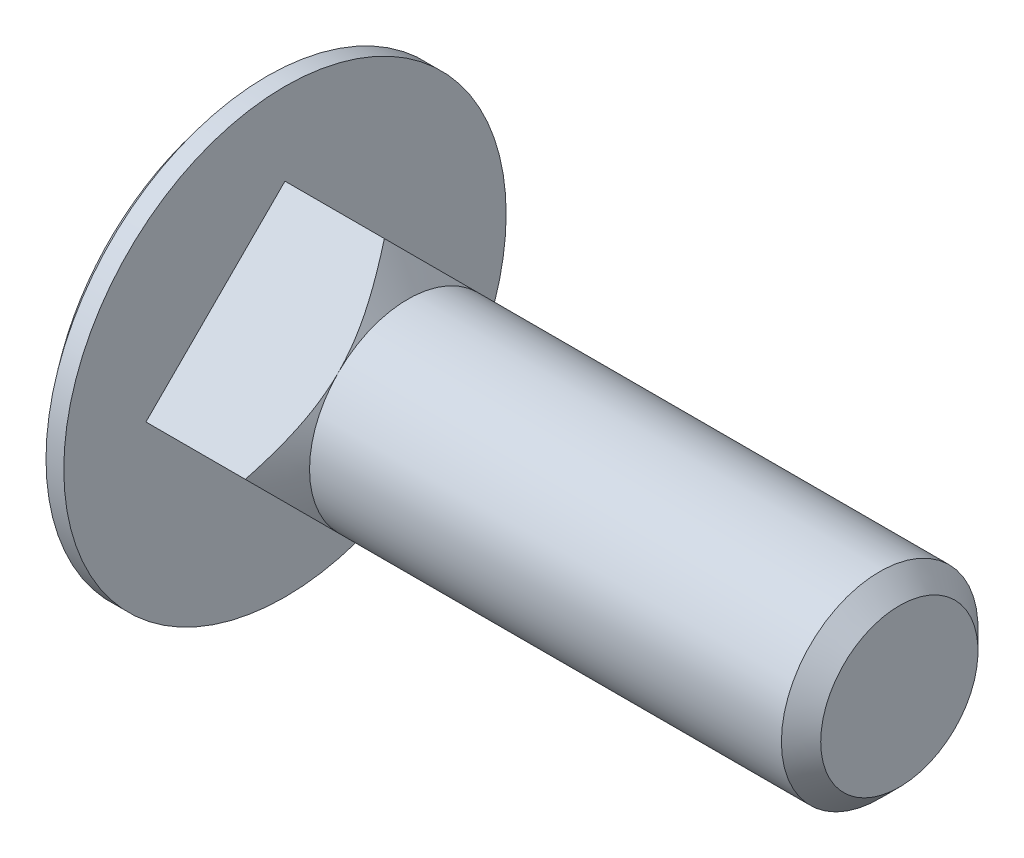
ISO-10303-21;
HEADER;
FILE_DESCRIPTION(('STEP AP214'),'2;1');
FILE_NAME('part.step','',(''),(''),'','','');
FILE_SCHEMA(('AUTOMOTIVE_DESIGN { 1 0 10303 214 1 1 1 1 }'));
ENDSEC;
DATA;
#1=APPLICATION_CONTEXT('core data for automotive mechanical design processes');
#2=APPLICATION_PROTOCOL_DEFINITION('international standard','automotive_design',2000,#1);
#3=PRODUCT_CONTEXT('',#1,'mechanical');
#4=PRODUCT('Part','Part','',(#3));
#5=PRODUCT_RELATED_PRODUCT_CATEGORY('part','',(#4));
#6=PRODUCT_DEFINITION_FORMATION('','',#4);
#7=PRODUCT_DEFINITION_CONTEXT('part definition',#1,'design');
#8=PRODUCT_DEFINITION('design','',#6,#7);
#9=PRODUCT_DEFINITION_SHAPE('','',#8);
#10=(LENGTH_UNIT() NAMED_UNIT(*) SI_UNIT(.MILLI.,.METRE.));
#11=(NAMED_UNIT(*) PLANE_ANGLE_UNIT() SI_UNIT($,.RADIAN.));
#12=(NAMED_UNIT(*) SI_UNIT($,.STERADIAN.) SOLID_ANGLE_UNIT());
#13=UNCERTAINTY_MEASURE_WITH_UNIT(LENGTH_MEASURE(1.E-05),#10,'distance_accuracy_value','');
#14=(GEOMETRIC_REPRESENTATION_CONTEXT(3) GLOBAL_UNCERTAINTY_ASSIGNED_CONTEXT((#13)) GLOBAL_UNIT_ASSIGNED_CONTEXT((#10,
#11,#12)) REPRESENTATION_CONTEXT('',''));
#15=CARTESIAN_POINT('',(0.,0.,0.));
#16=DIRECTION('',(0.,0.,1.));
#17=DIRECTION('',(1.,0.,0.));
#18=AXIS2_PLACEMENT_3D('',#15,#16,#17);
#19=CARTESIAN_POINT('',(5.,0.,-5.65685424949238));
#20=DIRECTION('',(0.,-0.707106781186548,0.707106781186547));
#21=DIRECTION('',(0.,-0.707106781186547,-0.707106781186548));
#22=AXIS2_PLACEMENT_3D('',#19,#20,#21);
#23=PLANE('',#22);
#24=CARTESIAN_POINT('',(4.0432992809527,-0.000199999999997203,-5.65705424949238));
#25=CARTESIAN_POINT('',(4.0988121730849,0.0959826975610581,-5.56087155193133));
#26=CARTESIAN_POINT('',(4.15314874397081,0.192512925868356,-5.46434132362403));
#27=CARTESIAN_POINT('',(4.25891257269784,0.386403970425592,-5.27045027906679));
#28=CARTESIAN_POINT('',(4.31033881318759,0.483765063597329,-5.17308918589505));
#29=CARTESIAN_POINT('',(4.40999239195148,0.67999010402872,-4.97686414546366));
#30=CARTESIAN_POINT('',(4.45819803762928,0.778859617281934,-4.87799463221045));
#31=CARTESIAN_POINT('',(4.55030115220739,0.977578113881361,-4.67927613561102));
#32=CARTESIAN_POINT('',(4.59419898628848,1.07742701341258,-4.5794272360798));
#33=CARTESIAN_POINT('',(4.71675397120088,1.37522438523122,-4.28162986426116));
#34=CARTESIAN_POINT('',(4.78803650897061,1.57478406535577,-4.08207018413662));
#35=CARTESIAN_POINT('',(4.87402002674739,1.87685506006528,-3.77999918942711));
#36=CARTESIAN_POINT('',(4.89917571351562,1.97789331377697,-3.67896093571541));
#37=CARTESIAN_POINT('',(4.94158803399933,2.18080322843218,-3.47605102106021));
#38=CARTESIAN_POINT('',(4.95884552100567,2.28267479813648,-3.3741794513559));
#39=CARTESIAN_POINT('',(4.98258260862343,2.47029261100635,-3.18656163848604));
#40=CARTESIAN_POINT('',(4.99036156700102,2.55595707997914,-3.10089716951324));
#41=CARTESIAN_POINT('',(4.99958487505313,2.72745668367036,-2.92939756582202));
#42=CARTESIAN_POINT('',(5.0010294360973,2.8132918125985,-2.84356243689389));
#43=CARTESIAN_POINT('',(4.99752840917008,2.98493500072988,-2.6719192487625));
#44=CARTESIAN_POINT('',(4.99257998405933,3.07074303099898,-2.5861112184934));
#45=CARTESIAN_POINT('',(4.97647161996125,3.24206110933229,-2.41479314016009));
#46=CARTESIAN_POINT('',(4.96531156855998,3.32757115197553,-2.32928309751685));
#47=CARTESIAN_POINT('',(4.92298687780489,3.58365082271443,-2.07320342677795));
#48=CARTESIAN_POINT('',(4.88298481412572,3.75350897480532,-1.90334527468706));
#49=CARTESIAN_POINT('',(4.78385371846953,4.09033307136895,-1.56652117812343));
#50=CARTESIAN_POINT('',(4.72472024883252,4.2572983353407,-1.39955591415168));
#51=CARTESIAN_POINT('',(4.61615701149807,4.52805544879868,-1.1287988006937));
#52=CARTESIAN_POINT('',(4.57102353308653,4.63273158851329,-1.02412266097909));
#53=CARTESIAN_POINT('',(4.47593584045967,4.84094698841374,-0.815907261078638));
#54=CARTESIAN_POINT('',(4.42598307451155,4.944486579796,-0.712367669696385));
#55=CARTESIAN_POINT('',(4.32239305174513,5.1500306413531,-0.506823608139283));
#56=CARTESIAN_POINT('',(4.26877610864834,5.25204027280366,-0.404813976688719));
#57=CARTESIAN_POINT('',(4.15830115357197,5.45517888423679,-0.201675365255595));
#58=CARTESIAN_POINT('',(4.10144317734359,5.55630787391935,-0.100546375573026));
#59=CARTESIAN_POINT('',(4.0432992809527,5.65705424949238,0.000200000000000509));
#60=B_SPLINE_CURVE_WITH_KNOTS('',3,(#24,#25,#26,#27,#28,#29,#30,#31,#32,#33,#34,#35,#36,#37,#38,
#39,#40,#41,#42,#43,#44,#45,#46,#47,#48,#49,#50,#51,#52,#53,#54,#55,#56,#57,#58,#59),
.UNSPECIFIED.,.F.,.F.,(4,2,2,2,2,2,2,2,2,2,2,2,2,2,2,2,2,4),(0.,0.440752806504666,
0.881658745236336,1.32528480094056,1.76887321713796,2.64086686263563,3.07595260990611,
3.51099134109739,3.87502779768151,4.23905210680467,4.60323802155864,4.96743052732496,
5.69691808802417,6.42657497979712,6.89077929314766,7.35484453820602,7.81651833086278,
8.27818703187038),.UNSPECIFIED.);
#61=CARTESIAN_POINT('',(4.0434147530477,0.,-5.65685424949238));
#62=VERTEX_POINT('',#61);
#63=CARTESIAN_POINT('',(4.99999999999989,2.82842712474619,-2.82842712474619));
#64=VERTEX_POINT('',#63);
#65=EDGE_CURVE('E225',#62,#64,#60,.T.);
#66=ORIENTED_EDGE('',*,*,#65,.F.);
#67=DIRECTION('',(-1.,0.,0.));
#68=VECTOR('',#67,1.);
#69=CARTESIAN_POINT('',(5.,0.,-5.65685424949238));
#70=LINE('',#69,#68);
#71=CARTESIAN_POINT('',(0.,0.,-5.65685424949238));
#72=VERTEX_POINT('',#71);
#73=EDGE_CURVE('E168',#62,#72,#70,.T.);
#74=ORIENTED_EDGE('',*,*,#73,.T.);
#75=DIRECTION('',(0.,0.707106781186547,0.707106781186548));
#76=VECTOR('',#75,1.);
#77=CARTESIAN_POINT('',(0.,0.,-5.65685424949238));
#78=LINE('',#77,#76);
#79=CARTESIAN_POINT('',(0.,5.65685424949238,0.));
#80=VERTEX_POINT('',#79);
#81=EDGE_CURVE('E223',#72,#80,#78,.T.);
#82=ORIENTED_EDGE('',*,*,#81,.T.);
#83=DIRECTION('',(-1.,0.,0.));
#84=VECTOR('',#83,1.);
#85=CARTESIAN_POINT('',(5.,5.65685424949238,0.));
#86=LINE('',#85,#84);
#87=CARTESIAN_POINT('',(4.0434147530477,5.65685424949238,0.));
#88=VERTEX_POINT('',#87);
#89=EDGE_CURVE('E170',#88,#80,#86,.T.);
#90=ORIENTED_EDGE('',*,*,#89,.F.);
#91=EDGE_CURVE('E96',#64,#88,#60,.T.);
#92=ORIENTED_EDGE('',*,*,#91,.F.);
#93=EDGE_LOOP('',(#66,#74,#82,#90,#92));
#94=FACE_BOUND('',#93,.T.);
#95=ADVANCED_FACE('F37',(#94),#23,.F.);
#96=CARTESIAN_POINT('',(5.,5.65685424949238,0.));
#97=DIRECTION('',(0.,-0.707106781186547,-0.707106781186548));
#98=DIRECTION('',(0.,0.707106781186548,-0.707106781186547));
#99=AXIS2_PLACEMENT_3D('',#96,#97,#98);
#100=PLANE('',#99);
#101=CARTESIAN_POINT('',(4.0432992809527,5.65705424949238,-0.000199999999999517));
#102=CARTESIAN_POINT('',(4.0988121730849,5.56087155193133,0.0959826975610555));
#103=CARTESIAN_POINT('',(4.15314874397081,5.46434132362403,0.192512925868354));
#104=CARTESIAN_POINT('',(4.25891257269784,5.27045027906679,0.386403970425589));
#105=CARTESIAN_POINT('',(4.31033881318759,5.17308918589505,0.483765063597326));
#106=CARTESIAN_POINT('',(4.40999239195148,4.97686414546367,0.679990104028717));
#107=CARTESIAN_POINT('',(4.45819803762928,4.87799463221045,0.778859617281931));
#108=CARTESIAN_POINT('',(4.55030115220739,4.67927613561102,0.977578113881358));
#109=CARTESIAN_POINT('',(4.59419898628848,4.5794272360798,1.07742701341258));
#110=CARTESIAN_POINT('',(4.71675397120088,4.28162986426116,1.37522438523122));
#111=CARTESIAN_POINT('',(4.78803650897062,4.08207018413662,1.57478406535577));
#112=CARTESIAN_POINT('',(4.87402002674739,3.77999918942711,1.87685506006528));
#113=CARTESIAN_POINT('',(4.89917571351562,3.67896093571541,1.97789331377697));
#114=CARTESIAN_POINT('',(4.94158803399933,3.47605102106021,2.18080322843217));
#115=CARTESIAN_POINT('',(4.95884552100567,3.3741794513559,2.28267479813648));
#116=CARTESIAN_POINT('',(4.98258260862343,3.18656163848604,2.47029261100634));
#117=CARTESIAN_POINT('',(4.99036156700102,3.10089716951324,2.55595707997914));
#118=CARTESIAN_POINT('',(4.99958487505313,2.92939756582202,2.72745668367036));
#119=CARTESIAN_POINT('',(5.0010294360973,2.84356243689388,2.8132918125985));
#120=CARTESIAN_POINT('',(4.99752840917008,2.6719192487625,2.98493500072988));
#121=CARTESIAN_POINT('',(4.99257998405933,2.5861112184934,3.07074303099898));
#122=CARTESIAN_POINT('',(4.97647161996125,2.41479314016009,3.24206110933229));
#123=CARTESIAN_POINT('',(4.96531156855998,2.32928309751685,3.32757115197553));
#124=CARTESIAN_POINT('',(4.92298687780489,2.07320342677795,3.58365082271443));
#125=CARTESIAN_POINT('',(4.88298481412572,1.90334527468706,3.75350897480532));
#126=CARTESIAN_POINT('',(4.78385371846953,1.56652117812343,4.09033307136895));
#127=CARTESIAN_POINT('',(4.72472024883252,1.39955591415168,4.2572983353407));
#128=CARTESIAN_POINT('',(4.61615701149807,1.1287988006937,4.52805544879868));
#129=CARTESIAN_POINT('',(4.57102353308653,1.02412266097909,4.63273158851329));
#130=CARTESIAN_POINT('',(4.47593584045967,0.815907261078637,4.84094698841374));
#131=CARTESIAN_POINT('',(4.42598307451155,0.712367669696384,4.94448657979599));
#132=CARTESIAN_POINT('',(4.32239305174513,0.506823608139283,5.1500306413531));
#133=CARTESIAN_POINT('',(4.26877610864834,0.404813976688719,5.25204027280366));
#134=CARTESIAN_POINT('',(4.15830115357197,0.201675365255595,5.45517888423678));
#135=CARTESIAN_POINT('',(4.10144317734359,0.100546375573025,5.55630787391935));
#136=CARTESIAN_POINT('',(4.0432992809527,-0.000200000000001083,5.65705424949238));
#137=B_SPLINE_CURVE_WITH_KNOTS('',3,(#101,#102,#103,#104,#105,#106,#107,#108,#109,#110,#111,
#112,#113,#114,#115,#116,#117,#118,#119,#120,#121,#122,#123,#124,#125,#126,#127,#128,#129,#130,
#131,#132,#133,#134,#135,#136),.UNSPECIFIED.,.F.,.F.,(4,2,2,2,2,2,2,2,2,2,2,2,2,2,2,2,2,4),(0.,
0.440752806504666,0.881658745236335,1.32528480094056,1.76887321713796,2.64086686263563,
3.07595260990611,3.51099134109739,3.87502779768151,4.23905210680467,4.60323802155864,
4.96743052732497,5.69691808802418,6.42657497979713,6.89077929314766,7.35484453820602,
7.81651833086278,8.27818703187039),.UNSPECIFIED.);
#138=CARTESIAN_POINT('',(4.99999999999989,2.82842712474619,2.82842712474619));
#139=VERTEX_POINT('',#138);
#140=EDGE_CURVE('E90',#88,#139,#137,.T.);
#141=ORIENTED_EDGE('',*,*,#140,.F.);
#142=ORIENTED_EDGE('',*,*,#89,.T.);
#143=DIRECTION('',(0.,-0.707106781186548,0.707106781186547));
#144=VECTOR('',#143,1.);
#145=CARTESIAN_POINT('',(0.,5.65685424949238,0.));
#146=LINE('',#145,#144);
#147=CARTESIAN_POINT('',(0.,0.,5.65685424949238));
#148=VERTEX_POINT('',#147);
#149=EDGE_CURVE('E224',#80,#148,#146,.T.);
#150=ORIENTED_EDGE('',*,*,#149,.T.);
#151=DIRECTION('',(-1.,0.,0.));
#152=VECTOR('',#151,1.);
#153=CARTESIAN_POINT('',(5.,0.,5.65685424949238));
#154=LINE('',#153,#152);
#155=CARTESIAN_POINT('',(4.0434147530477,0.,5.65685424949238));
#156=VERTEX_POINT('',#155);
#157=EDGE_CURVE('E114',#156,#148,#154,.T.);
#158=ORIENTED_EDGE('',*,*,#157,.F.);
#159=EDGE_CURVE('E100',#139,#156,#137,.T.);
#160=ORIENTED_EDGE('',*,*,#159,.F.);
#161=EDGE_LOOP('',(#141,#142,#150,#158,#160));
#162=FACE_BOUND('',#161,.T.);
#163=ADVANCED_FACE('F112',(#162),#100,.F.);
#164=CARTESIAN_POINT('',(5.,0.,5.65685424949238));
#165=DIRECTION('',(0.,0.707106781186548,-0.707106781186548));
#166=DIRECTION('',(0.,0.707106781186548,0.707106781186548));
#167=AXIS2_PLACEMENT_3D('',#164,#165,#166);
#168=PLANE('',#167);
#169=CARTESIAN_POINT('',(4.0432992809527,0.000199999999999738,5.65705424949238));
#170=CARTESIAN_POINT('',(4.0988121730849,-0.0959826975610552,5.56087155193132));
#171=CARTESIAN_POINT('',(4.15314874397081,-0.192512925868354,5.46434132362403));
#172=CARTESIAN_POINT('',(4.25891257269784,-0.386403970425589,5.27045027906679));
#173=CARTESIAN_POINT('',(4.31033881318759,-0.483765063597326,5.17308918589505));
#174=CARTESIAN_POINT('',(4.40999239195148,-0.679990104028717,4.97686414546366));
#175=CARTESIAN_POINT('',(4.45819803762928,-0.778859617281931,4.87799463221045));
#176=CARTESIAN_POINT('',(4.5503011522074,-0.977578113881358,4.67927613561102));
#177=CARTESIAN_POINT('',(4.59419898628848,-1.07742701341258,4.5794272360798));
#178=CARTESIAN_POINT('',(4.71675397120088,-1.37522438523122,4.28162986426116));
#179=CARTESIAN_POINT('',(4.78803650897062,-1.57478406535577,4.08207018413661));
#180=CARTESIAN_POINT('',(4.87402002674739,-1.87685506006528,3.7799991894271));
#181=CARTESIAN_POINT('',(4.89917571351563,-1.97789331377697,3.67896093571541));
#182=CARTESIAN_POINT('',(4.94158803399933,-2.18080322843218,3.4760510210602));
#183=CARTESIAN_POINT('',(4.95884552100567,-2.28267479813648,3.3741794513559));
#184=CARTESIAN_POINT('',(4.98258260862343,-2.47029261100634,3.18656163848603));
#185=CARTESIAN_POINT('',(4.99036156700102,-2.55595707997914,3.10089716951324));
#186=CARTESIAN_POINT('',(4.99958487505313,-2.72745668367036,2.92939756582202));
#187=CARTESIAN_POINT('',(5.0010294360973,-2.8132918125985,2.84356243689388));
#188=CARTESIAN_POINT('',(4.99752840917008,-2.98493500072988,2.6719192487625));
#189=CARTESIAN_POINT('',(4.99257998405933,-3.07074303099898,2.5861112184934));
#190=CARTESIAN_POINT('',(4.97647161996125,-3.24206110933229,2.41479314016009));
#191=CARTESIAN_POINT('',(4.96531156855998,-3.32757115197553,2.32928309751685));
#192=CARTESIAN_POINT('',(4.92298687780489,-3.58365082271443,2.07320342677795));
#193=CARTESIAN_POINT('',(4.88298481412572,-3.75350897480532,1.90334527468706));
#194=CARTESIAN_POINT('',(4.78385371846953,-4.09033307136895,1.56652117812342));
#195=CARTESIAN_POINT('',(4.72472024883252,-4.2572983353407,1.39955591415168));
#196=CARTESIAN_POINT('',(4.61615701149807,-4.52805544879868,1.1287988006937));
#197=CARTESIAN_POINT('',(4.57102353308653,-4.63273158851329,1.02412266097909));
#198=CARTESIAN_POINT('',(4.47593584045967,-4.84094698841374,0.815907261078637));
#199=CARTESIAN_POINT('',(4.42598307451155,-4.944486579796,0.712367669696384));
#200=CARTESIAN_POINT('',(4.32239305174513,-5.1500306413531,0.506823608139282));
#201=CARTESIAN_POINT('',(4.26877610864834,-5.25204027280366,0.404813976688718));
#202=CARTESIAN_POINT('',(4.15830115357197,-5.45517888423678,0.201675365255594));
#203=CARTESIAN_POINT('',(4.10144317734359,-5.55630787391935,0.100546375573025));
#204=CARTESIAN_POINT('',(4.0432992809527,-5.65705424949238,-0.000200000000001106));
#205=B_SPLINE_CURVE_WITH_KNOTS('',3,(#169,#170,#171,#172,#173,#174,#175,#176,#177,#178,#179,
#180,#181,#182,#183,#184,#185,#186,#187,#188,#189,#190,#191,#192,#193,#194,#195,#196,#197,#198,
#199,#200,#201,#202,#203,#204),.UNSPECIFIED.,.F.,.F.,(4,2,2,2,2,2,2,2,2,2,2,2,2,2,2,2,2,4),(0.,
0.440752806504666,0.881658745236335,1.32528480094056,1.76887321713796,2.64086686263563,
3.07595260990612,3.51099134109739,3.87502779768151,4.23905210680467,4.60323802155864,
4.96743052732497,5.69691808802418,6.42657497979713,6.89077929314766,7.35484453820602,
7.81651833086278,8.27818703187039),.UNSPECIFIED.);
#206=CARTESIAN_POINT('',(4.99999999999989,-2.82842712474619,2.82842712474619));
#207=VERTEX_POINT('',#206);
#208=EDGE_CURVE('E106',#156,#207,#205,.T.);
#209=ORIENTED_EDGE('',*,*,#208,.F.);
#210=ORIENTED_EDGE('',*,*,#157,.T.);
#211=DIRECTION('',(0.,-0.707106781186548,-0.707106781186548));
#212=VECTOR('',#211,1.);
#213=CARTESIAN_POINT('',(0.,0.,5.65685424949238));
#214=LINE('',#213,#212);
#215=CARTESIAN_POINT('',(0.,-5.65685424949238,0.));
#216=VERTEX_POINT('',#215);
#217=EDGE_CURVE('E167',#148,#216,#214,.T.);
#218=ORIENTED_EDGE('',*,*,#217,.T.);
#219=DIRECTION('',(-1.,0.,0.));
#220=VECTOR('',#219,1.);
#221=CARTESIAN_POINT('',(5.,-5.65685424949238,0.));
#222=LINE('',#221,#220);
#223=CARTESIAN_POINT('',(4.0434147530477,-5.65685424949238,0.));
#224=VERTEX_POINT('',#223);
#225=EDGE_CURVE('E161',#224,#216,#222,.T.);
#226=ORIENTED_EDGE('',*,*,#225,.F.);
#227=EDGE_CURVE('E115',#207,#224,#205,.T.);
#228=ORIENTED_EDGE('',*,*,#227,.F.);
#229=EDGE_LOOP('',(#209,#210,#218,#226,#228));
#230=FACE_BOUND('',#229,.T.);
#231=ADVANCED_FACE('F165',(#230),#168,.F.);
#232=CARTESIAN_POINT('',(5.,-5.65685424949238,0.));
#233=DIRECTION('',(0.,0.707106781186547,0.707106781186548));
#234=DIRECTION('',(0.,-0.707106781186548,0.707106781186547));
#235=AXIS2_PLACEMENT_3D('',#232,#233,#234);
#236=PLANE('',#235);
#237=CARTESIAN_POINT('',(4.0432992809527,-5.65705424949238,0.000200000000000074));
#238=CARTESIAN_POINT('',(4.0988121730849,-5.56087155193132,-0.0959826975610549));
#239=CARTESIAN_POINT('',(4.15314874397082,-5.46434132362403,-0.192512925868354));
#240=CARTESIAN_POINT('',(4.25891257269784,-5.27045027906679,-0.38640397042559));
#241=CARTESIAN_POINT('',(4.31033881318759,-5.17308918589505,-0.483765063597326));
#242=CARTESIAN_POINT('',(4.40999239195148,-4.97686414546366,-0.679990104028717));
#243=CARTESIAN_POINT('',(4.45819803762928,-4.87799463221045,-0.778859617281931));
#244=CARTESIAN_POINT('',(4.5503011522074,-4.67927613561102,-0.977578113881358));
#245=CARTESIAN_POINT('',(4.59419898628848,-4.5794272360798,-1.07742701341258));
#246=CARTESIAN_POINT('',(4.71675397120088,-4.28162986426116,-1.37522438523122));
#247=CARTESIAN_POINT('',(4.78803650897062,-4.08207018413661,-1.57478406535577));
#248=CARTESIAN_POINT('',(4.87402002674739,-3.7799991894271,-1.87685506006528));
#249=CARTESIAN_POINT('',(4.89917571351563,-3.67896093571541,-1.97789331377697));
#250=CARTESIAN_POINT('',(4.94158803399933,-3.4760510210602,-2.18080322843218));
#251=CARTESIAN_POINT('',(4.95884552100567,-3.3741794513559,-2.28267479813648));
#252=CARTESIAN_POINT('',(4.98258260862343,-3.18656163848603,-2.47029261100634));
#253=CARTESIAN_POINT('',(4.99036156700102,-3.10089716951324,-2.55595707997914));
#254=CARTESIAN_POINT('',(4.99958487505313,-2.92939756582202,-2.72745668367036));
#255=CARTESIAN_POINT('',(5.0010294360973,-2.84356243689388,-2.8132918125985));
#256=CARTESIAN_POINT('',(4.99752840917008,-2.6719192487625,-2.98493500072988));
#257=CARTESIAN_POINT('',(4.99257998405933,-2.5861112184934,-3.07074303099898));
#258=CARTESIAN_POINT('',(4.97647161996125,-2.41479314016009,-3.24206110933229));
#259=CARTESIAN_POINT('',(4.96531156855998,-2.32928309751685,-3.32757115197553));
#260=CARTESIAN_POINT('',(4.92298687780489,-2.07320342677795,-3.58365082271443));
#261=CARTESIAN_POINT('',(4.88298481412572,-1.90334527468706,-3.75350897480532));
#262=CARTESIAN_POINT('',(4.78385371846953,-1.56652117812342,-4.09033307136896));
#263=CARTESIAN_POINT('',(4.72472024883252,-1.39955591415168,-4.2572983353407));
#264=CARTESIAN_POINT('',(4.61615701149807,-1.1287988006937,-4.52805544879868));
#265=CARTESIAN_POINT('',(4.57102353308653,-1.02412266097908,-4.63273158851329));
#266=CARTESIAN_POINT('',(4.47593584045967,-0.815907261078636,-4.84094698841374));
#267=CARTESIAN_POINT('',(4.42598307451155,-0.712367669696383,-4.944486579796));
#268=CARTESIAN_POINT('',(4.32239305174513,-0.506823608139281,-5.1500306413531));
#269=CARTESIAN_POINT('',(4.26877610864834,-0.404813976688718,-5.25204027280366));
#270=CARTESIAN_POINT('',(4.15830115357197,-0.201675365255594,-5.45517888423679));
#271=CARTESIAN_POINT('',(4.10144317734359,-0.100546375573024,-5.55630787391935));
#272=CARTESIAN_POINT('',(4.0432992809527,0.00020000000000236,-5.65705424949238));
#273=B_SPLINE_CURVE_WITH_KNOTS('',3,(#237,#238,#239,#240,#241,#242,#243,#244,#245,#246,#247,
#248,#249,#250,#251,#252,#253,#254,#255,#256,#257,#258,#259,#260,#261,#262,#263,#264,#265,#266,
#267,#268,#269,#270,#271,#272),.UNSPECIFIED.,.F.,.F.,(4,2,2,2,2,2,2,2,2,2,2,2,2,2,2,2,2,4),(0.,
0.440752806504667,0.881658745236336,1.32528480094056,1.76887321713796,2.64086686263563,
3.07595260990612,3.51099134109739,3.87502779768151,4.23905210680467,4.60323802155864,
4.96743052732497,5.69691808802418,6.42657497979713,6.89077929314766,7.35484453820602,
7.81651833086278,8.27818703187039),.UNSPECIFIED.);
#274=CARTESIAN_POINT('',(5.,-2.82842712474619,-2.82842712474619));
#275=VERTEX_POINT('',#274);
#276=EDGE_CURVE('E153',#224,#275,#273,.T.);
#277=ORIENTED_EDGE('',*,*,#276,.F.);
#278=ORIENTED_EDGE('',*,*,#225,.T.);
#279=DIRECTION('',(0.,0.707106781186548,-0.707106781186547));
#280=VECTOR('',#279,1.);
#281=CARTESIAN_POINT('',(0.,-5.65685424949238,0.));
#282=LINE('',#281,#280);
#283=EDGE_CURVE('E172',#216,#72,#282,.T.);
#284=ORIENTED_EDGE('',*,*,#283,.T.);
#285=ORIENTED_EDGE('',*,*,#73,.F.);
#286=EDGE_CURVE('E147',#275,#62,#273,.T.);
#287=ORIENTED_EDGE('',*,*,#286,.F.);
#288=EDGE_LOOP('',(#277,#278,#284,#285,#287));
#289=FACE_BOUND('',#288,.T.);
#290=ADVANCED_FACE('F143',(#289),#236,.F.);
#291=CARTESIAN_POINT('',(0.,9.,0.));
#292=DIRECTION('',(-1.,0.,0.));
#293=DIRECTION('',(0.,0.,1.));
#294=AXIS2_PLACEMENT_3D('',#291,#292,#293);
#295=PLANE('',#294);
#296=CARTESIAN_POINT('',(0.,0.,0.));
#297=DIRECTION('',(-1.,0.,0.));
#298=DIRECTION('',(0.,0.,1.));
#299=AXIS2_PLACEMENT_3D('',#296,#297,#298);
#300=CIRCLE('',#299,9.);
#301=CARTESIAN_POINT('',(0.,0.,9.));
#302=VERTEX_POINT('',#301);
#303=EDGE_CURVE('E177',#302,#302,#300,.T.);
#304=ORIENTED_EDGE('',*,*,#303,.F.);
#305=EDGE_LOOP('',(#304));
#306=FACE_BOUND('',#305,.T.);
#307=ORIENTED_EDGE('',*,*,#81,.F.);
#308=ORIENTED_EDGE('',*,*,#283,.F.);
#309=ORIENTED_EDGE('',*,*,#217,.F.);
#310=ORIENTED_EDGE('',*,*,#149,.F.);
#311=EDGE_LOOP('',(#307,#308,#309,#310));
#312=FACE_BOUND('',#311,.T.);
#313=ADVANCED_FACE('F204',(#306,#312),#295,.F.);
#314=CARTESIAN_POINT('',(10.,0.,0.));
#315=DIRECTION('',(-1.,0.,0.));
#316=DIRECTION('',(0.,1.,0.));
#317=AXIS2_PLACEMENT_3D('',#314,#315,#316);
#318=SPHERICAL_SURFACE('',#317,14.);
#319=CARTESIAN_POINT('',(-0.723805294763596,0.,0.));
#320=DIRECTION('',(-1.,0.,0.));
#321=DIRECTION('',(0.,0.,1.));
#322=AXIS2_PLACEMENT_3D('',#319,#320,#321);
#323=CIRCLE('',#322,9.);
#324=CARTESIAN_POINT('',(-0.723805294763596,0.,9.));
#325=VERTEX_POINT('',#324);
#326=EDGE_CURVE('E180',#325,#325,#323,.T.);
#327=ORIENTED_EDGE('',*,*,#326,.T.);
#328=EDGE_LOOP('',(#327));
#329=FACE_BOUND('',#328,.T.);
#330=ADVANCED_FACE('F207',(#329),#318,.T.);
#331=CARTESIAN_POINT('',(-168.009043503741,0.,0.));
#332=DIRECTION('',(-1.,0.,0.));
#333=DIRECTION('',(0.,0.,1.));
#334=AXIS2_PLACEMENT_3D('',#331,#332,#333);
#335=CYLINDRICAL_SURFACE('',#334,9.);
#336=ORIENTED_EDGE('',*,*,#326,.F.);
#337=EDGE_LOOP('',(#336));
#338=FACE_BOUND('',#337,.T.);
#339=ORIENTED_EDGE('',*,*,#303,.T.);
#340=EDGE_LOOP('',(#339));
#341=FACE_BOUND('',#340,.T.);
#342=ADVANCED_FACE('F209',(#338,#341),#335,.T.);
#343=CARTESIAN_POINT('',(4.0434147530477,0.,0.));
#344=DIRECTION('',(-1.,0.,0.));
#345=DIRECTION('',(0.,0.,1.));
#346=AXIS2_PLACEMENT_3D('',#343,#344,#345);
#347=CONICAL_SURFACE('',#346,5.65685424949238,1.04719755119669);
#348=ORIENTED_EDGE('',*,*,#159,.T.);
#349=ORIENTED_EDGE('',*,*,#208,.T.);
#350=CARTESIAN_POINT('',(5.,0.,0.));
#351=DIRECTION('',(1.,0.,0.));
#352=DIRECTION('',(0.,0.,-1.));
#353=AXIS2_PLACEMENT_3D('',#350,#351,#352);
#354=CIRCLE('',#353,4.);
#355=EDGE_CURVE('E103',#139,#207,#354,.T.);
#356=ORIENTED_EDGE('',*,*,#355,.F.);
#357=EDGE_LOOP('',(#348,#349,#356));
#358=FACE_BOUND('',#357,.T.);
#359=ADVANCED_FACE('F104',(#358),#347,.T.);
#360=ORIENTED_EDGE('',*,*,#91,.T.);
#361=ORIENTED_EDGE('',*,*,#140,.T.);
#362=EDGE_CURVE('E94',#64,#139,#354,.T.);
#363=ORIENTED_EDGE('',*,*,#362,.F.);
#364=EDGE_LOOP('',(#360,#361,#363));
#365=FACE_BOUND('',#364,.T.);
#366=ADVANCED_FACE('F92',(#365),#347,.T.);
#367=ORIENTED_EDGE('',*,*,#65,.T.);
#368=EDGE_CURVE('E110',#275,#64,#354,.T.);
#369=ORIENTED_EDGE('',*,*,#368,.F.);
#370=ORIENTED_EDGE('',*,*,#286,.T.);
#371=EDGE_LOOP('',(#367,#369,#370));
#372=FACE_BOUND('',#371,.T.);
#373=ADVANCED_FACE('F137',(#372),#347,.T.);
#374=ORIENTED_EDGE('',*,*,#227,.T.);
#375=ORIENTED_EDGE('',*,*,#276,.T.);
#376=EDGE_CURVE('E52',#207,#275,#354,.T.);
#377=ORIENTED_EDGE('',*,*,#376,.F.);
#378=EDGE_LOOP('',(#374,#375,#377));
#379=FACE_BOUND('',#378,.T.);
#380=ADVANCED_FACE('F141',(#379),#347,.T.);
#381=CARTESIAN_POINT('',(25.,4.,0.));
#382=DIRECTION('',(-1.,0.,0.));
#383=DIRECTION('',(0.,0.,1.));
#384=AXIS2_PLACEMENT_3D('',#381,#382,#383);
#385=PLANE('',#384);
#386=CARTESIAN_POINT('',(25.,0.,0.));
#387=DIRECTION('',(-1.,0.,0.));
#388=DIRECTION('',(0.,0.,1.));
#389=AXIS2_PLACEMENT_3D('',#386,#387,#388);
#390=CIRCLE('',#389,3.19999999999998);
#391=CARTESIAN_POINT('',(25.,0.,3.19999999999998));
#392=VERTEX_POINT('',#391);
#393=EDGE_CURVE('E11',#392,#392,#390,.F.);
#394=ORIENTED_EDGE('',*,*,#393,.T.);
#395=EDGE_LOOP('',(#394));
#396=FACE_BOUND('',#395,.T.);
#397=ADVANCED_FACE('F191',(#396),#385,.F.);
#398=CARTESIAN_POINT('',(-168.009043503741,0.,0.));
#399=DIRECTION('',(-1.,0.,0.));
#400=DIRECTION('',(0.,0.,1.));
#401=AXIS2_PLACEMENT_3D('',#398,#399,#400);
#402=CYLINDRICAL_SURFACE('',#401,4.);
#403=CARTESIAN_POINT('',(24.2,0.,0.));
#404=DIRECTION('',(-1.,0.,0.));
#405=DIRECTION('',(0.,0.,1.));
#406=AXIS2_PLACEMENT_3D('',#403,#404,#405);
#407=CIRCLE('',#406,4.);
#408=CARTESIAN_POINT('',(24.2,0.,4.));
#409=VERTEX_POINT('',#408);
#410=EDGE_CURVE('E45',#409,#409,#407,.T.);
#411=ORIENTED_EDGE('',*,*,#410,.T.);
#412=EDGE_LOOP('',(#411));
#413=FACE_BOUND('',#412,.T.);
#414=ORIENTED_EDGE('',*,*,#368,.T.);
#415=ORIENTED_EDGE('',*,*,#362,.T.);
#416=ORIENTED_EDGE('',*,*,#355,.T.);
#417=ORIENTED_EDGE('',*,*,#376,.T.);
#418=EDGE_LOOP('',(#414,#415,#416,#417));
#419=FACE_BOUND('',#418,.T.);
#420=ADVANCED_FACE('F109',(#413,#419),#402,.T.);
#421=CARTESIAN_POINT('',(24.2,0.,0.));
#422=DIRECTION('',(-1.,0.,0.));
#423=DIRECTION('',(0.,0.,1.));
#424=AXIS2_PLACEMENT_3D('',#421,#422,#423);
#425=CONICAL_SURFACE('',#424,4.,0.785398163397461);
#426=ORIENTED_EDGE('',*,*,#393,.F.);
#427=EDGE_LOOP('',(#426));
#428=FACE_BOUND('',#427,.T.);
#429=ORIENTED_EDGE('',*,*,#410,.F.);
#430=EDGE_LOOP('',(#429));
#431=FACE_BOUND('',#430,.T.);
#432=ADVANCED_FACE('F39',(#428,#431),#425,.T.);
#433=CLOSED_SHELL('',(#95,#163,#231,#290,#313,#330,#342,#359,#366,#373,#380,#397,#420,#432));
#434=MANIFOLD_SOLID_BREP('B2',#433);
#435=ADVANCED_BREP_SHAPE_REPRESENTATION('',(#18,#434),#14);
#436=SHAPE_DEFINITION_REPRESENTATION(#9,#435);
ENDSEC;
END-ISO-10303-21;
